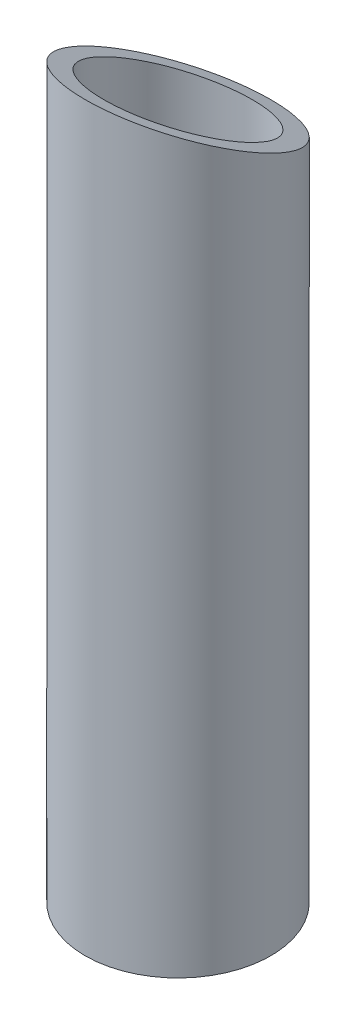
ISO-10303-21;
HEADER;
FILE_DESCRIPTION(('STEP AP214'),'2;1');
FILE_NAME('part.step','',(''),(''),'','','');
FILE_SCHEMA(('AUTOMOTIVE_DESIGN { 1 0 10303 214 1 1 1 1 }'));
ENDSEC;
DATA;
#1=APPLICATION_CONTEXT('core data for automotive mechanical design processes');
#2=APPLICATION_PROTOCOL_DEFINITION('international standard','automotive_design',2000,#1);
#3=PRODUCT_CONTEXT('',#1,'mechanical');
#4=PRODUCT('Part','Part','',(#3));
#5=PRODUCT_RELATED_PRODUCT_CATEGORY('part','',(#4));
#6=PRODUCT_DEFINITION_FORMATION('','',#4);
#7=PRODUCT_DEFINITION_CONTEXT('part definition',#1,'design');
#8=PRODUCT_DEFINITION('design','',#6,#7);
#9=PRODUCT_DEFINITION_SHAPE('','',#8);
#10=(LENGTH_UNIT() NAMED_UNIT(*) SI_UNIT(.MILLI.,.METRE.));
#11=(NAMED_UNIT(*) PLANE_ANGLE_UNIT() SI_UNIT($,.RADIAN.));
#12=(NAMED_UNIT(*) SI_UNIT($,.STERADIAN.) SOLID_ANGLE_UNIT());
#13=UNCERTAINTY_MEASURE_WITH_UNIT(LENGTH_MEASURE(1.E-05),#10,'distance_accuracy_value','');
#14=(GEOMETRIC_REPRESENTATION_CONTEXT(3) GLOBAL_UNCERTAINTY_ASSIGNED_CONTEXT((#13)) GLOBAL_UNIT_ASSIGNED_CONTEXT((#10,
#11,#12)) REPRESENTATION_CONTEXT('',''));
#15=CARTESIAN_POINT('',(0.,0.,0.));
#16=DIRECTION('',(0.,0.,1.));
#17=DIRECTION('',(1.,0.,0.));
#18=AXIS2_PLACEMENT_3D('',#15,#16,#17);
#19=CARTESIAN_POINT('',(0.,127.,0.));
#20=DIRECTION('',(0.,-1.,0.));
#21=DIRECTION('',(0.,0.,-1.));
#22=AXIS2_PLACEMENT_3D('',#19,#20,#21);
#23=CYLINDRICAL_SURFACE('',#22,15.9);
#24=CARTESIAN_POINT('',(0.,0.,0.));
#25=DIRECTION('',(0.,1.,0.));
#26=DIRECTION('',(0.,0.,1.));
#27=AXIS2_PLACEMENT_3D('',#24,#25,#26);
#28=CIRCLE('',#27,15.9);
#29=CARTESIAN_POINT('',(0.,0.,15.9));
#30=VERTEX_POINT('',#29);
#31=EDGE_CURVE('E10',#30,#30,#28,.T.);
#32=ORIENTED_EDGE('',*,*,#31,.T.);
#33=EDGE_LOOP('',(#32));
#34=FACE_BOUND('',#33,.T.);
#35=CARTESIAN_POINT('',(0.,119.05,0.));
#36=DIRECTION('',(0.,-0.894427190999916,0.447213595499958));
#37=DIRECTION('',(0.,-0.447213595499958,-0.894427190999916));
#38=AXIS2_PLACEMENT_3D('',#35,#36,#37);
#39=ELLIPSE('',#38,17.7767404211233,15.9);
#40=CARTESIAN_POINT('',(0.,111.1,-15.9));
#41=VERTEX_POINT('',#40);
#42=EDGE_CURVE('E39',#41,#41,#39,.T.);
#43=ORIENTED_EDGE('',*,*,#42,.T.);
#44=EDGE_LOOP('',(#43));
#45=FACE_BOUND('',#44,.T.);
#46=ADVANCED_FACE('F28',(#34,#45),#23,.T.);
#47=CARTESIAN_POINT('',(0.,0.,0.));
#48=DIRECTION('',(0.,1.,0.));
#49=DIRECTION('',(0.,0.,1.));
#50=AXIS2_PLACEMENT_3D('',#47,#48,#49);
#51=PLANE('',#50);
#52=ORIENTED_EDGE('',*,*,#31,.F.);
#53=EDGE_LOOP('',(#52));
#54=FACE_BOUND('',#53,.T.);
#55=CARTESIAN_POINT('',(0.,0.,0.));
#56=DIRECTION('',(0.,1.,0.));
#57=DIRECTION('',(0.,0.,1.));
#58=AXIS2_PLACEMENT_3D('',#55,#56,#57);
#59=CIRCLE('',#58,12.725);
#60=CARTESIAN_POINT('',(0.,0.,12.725));
#61=VERTEX_POINT('',#60);
#62=EDGE_CURVE('E35',#61,#61,#59,.T.);
#63=ORIENTED_EDGE('',*,*,#62,.T.);
#64=EDGE_LOOP('',(#63));
#65=FACE_BOUND('',#64,.T.);
#66=ADVANCED_FACE('F54',(#54,#65),#51,.F.);
#67=CARTESIAN_POINT('',(0.,127.,0.));
#68=DIRECTION('',(0.,-1.,0.));
#69=DIRECTION('',(0.,0.,-1.));
#70=AXIS2_PLACEMENT_3D('',#67,#68,#69);
#71=CYLINDRICAL_SURFACE('',#70,12.725);
#72=CARTESIAN_POINT('',(0.,119.05,0.));
#73=DIRECTION('',(0.,-0.894427190999916,0.447213595499958));
#74=DIRECTION('',(0.,-0.447213595499958,-0.894427190999916));
#75=AXIS2_PLACEMENT_3D('',#72,#73,#74);
#76=ELLIPSE('',#75,14.2269825068424,12.725);
#77=CARTESIAN_POINT('',(0.,112.6875,-12.725));
#78=VERTEX_POINT('',#77);
#79=EDGE_CURVE('E31',#78,#78,#76,.T.);
#80=ORIENTED_EDGE('',*,*,#79,.F.);
#81=EDGE_LOOP('',(#80));
#82=FACE_BOUND('',#81,.T.);
#83=ORIENTED_EDGE('',*,*,#62,.F.);
#84=EDGE_LOOP('',(#83));
#85=FACE_BOUND('',#84,.T.);
#86=ADVANCED_FACE('F51',(#82,#85),#71,.F.);
#87=CARTESIAN_POINT('',(-15.9,127.,15.9));
#88=DIRECTION('',(0.,-0.894427190999916,0.447213595499958));
#89=DIRECTION('',(0.,-0.447213595499958,-0.894427190999916));
#90=AXIS2_PLACEMENT_3D('',#87,#88,#89);
#91=PLANE('',#90);
#92=ORIENTED_EDGE('',*,*,#79,.T.);
#93=EDGE_LOOP('',(#92));
#94=FACE_BOUND('',#93,.T.);
#95=ORIENTED_EDGE('',*,*,#42,.F.);
#96=EDGE_LOOP('',(#95));
#97=FACE_BOUND('',#96,.T.);
#98=ADVANCED_FACE('F48',(#94,#97),#91,.F.);
#99=CLOSED_SHELL('',(#46,#66,#86,#98));
#100=MANIFOLD_SOLID_BREP('B2',#99);
#101=ADVANCED_BREP_SHAPE_REPRESENTATION('',(#18,#100),#14);
#102=SHAPE_DEFINITION_REPRESENTATION(#9,#101);
ENDSEC;
END-ISO-10303-21;
